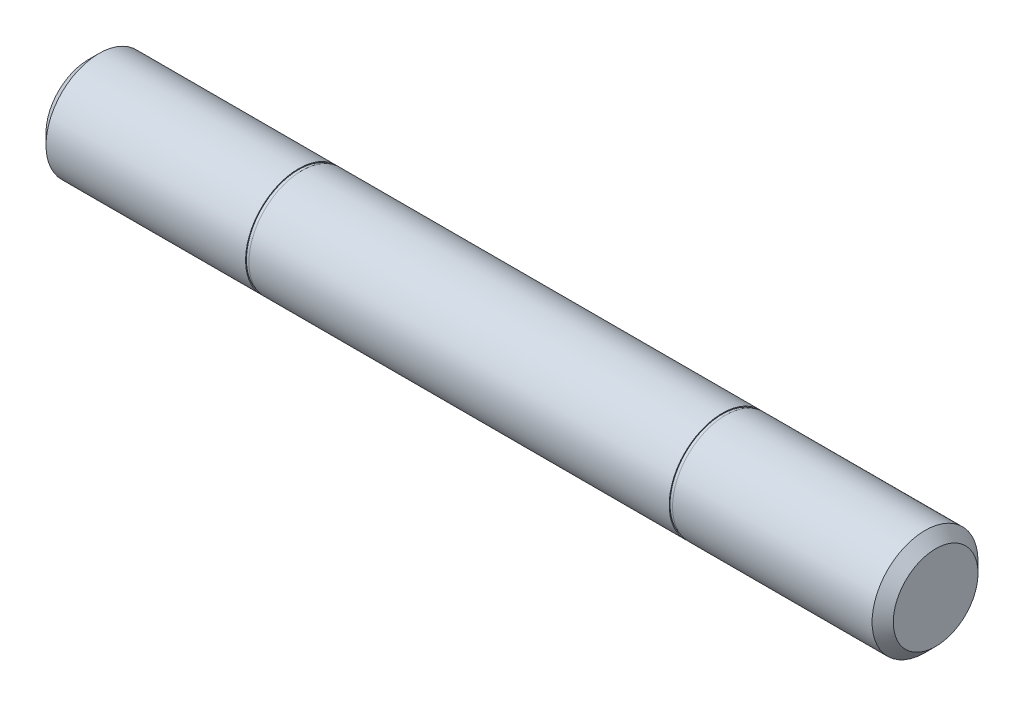
ISO-10303-21;
HEADER;
FILE_DESCRIPTION(('STEP AP214'),'2;1');
FILE_NAME('part.step','',(''),(''),'','','');
FILE_SCHEMA(('AUTOMOTIVE_DESIGN { 1 0 10303 214 1 1 1 1 }'));
ENDSEC;
DATA;
#1=APPLICATION_CONTEXT('core data for automotive mechanical design processes');
#2=APPLICATION_PROTOCOL_DEFINITION('international standard','automotive_design',2000,#1);
#3=PRODUCT_CONTEXT('',#1,'mechanical');
#4=PRODUCT('Part','Part','',(#3));
#5=PRODUCT_RELATED_PRODUCT_CATEGORY('part','',(#4));
#6=PRODUCT_DEFINITION_FORMATION('','',#4);
#7=PRODUCT_DEFINITION_CONTEXT('part definition',#1,'design');
#8=PRODUCT_DEFINITION('design','',#6,#7);
#9=PRODUCT_DEFINITION_SHAPE('','',#8);
#10=(LENGTH_UNIT() NAMED_UNIT(*) SI_UNIT(.MILLI.,.METRE.));
#11=(NAMED_UNIT(*) PLANE_ANGLE_UNIT() SI_UNIT($,.RADIAN.));
#12=(NAMED_UNIT(*) SI_UNIT($,.STERADIAN.) SOLID_ANGLE_UNIT());
#13=UNCERTAINTY_MEASURE_WITH_UNIT(LENGTH_MEASURE(1.E-05),#10,'distance_accuracy_value','');
#14=(GEOMETRIC_REPRESENTATION_CONTEXT(3) GLOBAL_UNCERTAINTY_ASSIGNED_CONTEXT((#13)) GLOBAL_UNIT_ASSIGNED_CONTEXT((#10,
#11,#12)) REPRESENTATION_CONTEXT('',''));
#15=CARTESIAN_POINT('',(0.,0.,0.));
#16=DIRECTION('',(0.,0.,1.));
#17=DIRECTION('',(1.,0.,0.));
#18=AXIS2_PLACEMENT_3D('',#15,#16,#17);
#19=CARTESIAN_POINT('',(-12.7,0.,0.));
#20=DIRECTION('',(1.,0.,0.));
#21=DIRECTION('',(0.,0.,-1.));
#22=AXIS2_PLACEMENT_3D('',#19,#20,#21);
#23=CYLINDRICAL_SURFACE('',#22,1.5875);
#24=CARTESIAN_POINT('',(-6.3,0.,0.));
#25=DIRECTION('',(-1.,0.,0.));
#26=DIRECTION('',(0.,0.,1.));
#27=AXIS2_PLACEMENT_3D('',#24,#25,#26);
#28=CIRCLE('',#27,1.5875);
#29=CARTESIAN_POINT('',(-6.3,0.,1.5875));
#30=VERTEX_POINT('',#29);
#31=EDGE_CURVE('E50',#30,#30,#28,.T.);
#32=ORIENTED_EDGE('',*,*,#31,.F.);
#33=EDGE_LOOP('',(#32));
#34=FACE_BOUND('',#33,.T.);
#35=CARTESIAN_POINT('',(6.3,0.,0.));
#36=DIRECTION('',(1.,0.,0.));
#37=DIRECTION('',(0.,0.,-1.));
#38=AXIS2_PLACEMENT_3D('',#35,#36,#37);
#39=CIRCLE('',#38,1.5875);
#40=CARTESIAN_POINT('',(6.3,0.,-1.5875));
#41=VERTEX_POINT('',#40);
#42=EDGE_CURVE('E60',#41,#41,#39,.T.);
#43=ORIENTED_EDGE('',*,*,#42,.F.);
#44=EDGE_LOOP('',(#43));
#45=FACE_BOUND('',#44,.T.);
#46=ADVANCED_FACE('F30',(#34,#45),#23,.T.);
#47=CARTESIAN_POINT('',(-6.3,0.,0.));
#48=DIRECTION('',(-1.,0.,0.));
#49=DIRECTION('',(0.,0.,1.));
#50=AXIS2_PLACEMENT_3D('',#47,#48,#49);
#51=PLANE('',#50);
#52=CARTESIAN_POINT('',(-6.3,0.,0.));
#53=DIRECTION('',(-1.,0.,0.));
#54=DIRECTION('',(0.,0.,1.));
#55=AXIS2_PLACEMENT_3D('',#52,#53,#54);
#56=CIRCLE('',#55,1.5621);
#57=CARTESIAN_POINT('',(-6.3,0.,1.5621));
#58=VERTEX_POINT('',#57);
#59=EDGE_CURVE('E54',#58,#58,#56,.T.);
#60=ORIENTED_EDGE('',*,*,#59,.F.);
#61=EDGE_LOOP('',(#60));
#62=FACE_BOUND('',#61,.T.);
#63=ORIENTED_EDGE('',*,*,#31,.T.);
#64=EDGE_LOOP('',(#63));
#65=FACE_BOUND('',#64,.T.);
#66=ADVANCED_FACE('F87',(#62,#65),#51,.T.);
#67=CARTESIAN_POINT('',(-6.4,0.,0.));
#68=DIRECTION('',(-1.,0.,0.));
#69=DIRECTION('',(0.,0.,1.));
#70=AXIS2_PLACEMENT_3D('',#67,#68,#69);
#71=PLANE('',#70);
#72=CARTESIAN_POINT('',(-6.4,0.,0.));
#73=DIRECTION('',(-1.,0.,0.));
#74=DIRECTION('',(0.,0.,1.));
#75=AXIS2_PLACEMENT_3D('',#72,#73,#74);
#76=CIRCLE('',#75,1.5621);
#77=CARTESIAN_POINT('',(-6.4,0.,1.5621));
#78=VERTEX_POINT('',#77);
#79=EDGE_CURVE('E57',#78,#78,#76,.T.);
#80=ORIENTED_EDGE('',*,*,#79,.T.);
#81=EDGE_LOOP('',(#80));
#82=FACE_BOUND('',#81,.T.);
#83=CARTESIAN_POINT('',(-6.4,0.,0.));
#84=DIRECTION('',(-1.,0.,0.));
#85=DIRECTION('',(0.,0.,1.));
#86=AXIS2_PLACEMENT_3D('',#83,#84,#85);
#87=CIRCLE('',#86,1.5875);
#88=CARTESIAN_POINT('',(-6.4,0.,1.5875));
#89=VERTEX_POINT('',#88);
#90=EDGE_CURVE('E51',#89,#89,#87,.T.);
#91=ORIENTED_EDGE('',*,*,#90,.F.);
#92=EDGE_LOOP('',(#91));
#93=FACE_BOUND('',#92,.T.);
#94=ADVANCED_FACE('F94',(#82,#93),#71,.F.);
#95=CARTESIAN_POINT('',(-6.3,0.,0.));
#96=DIRECTION('',(-1.,0.,0.));
#97=DIRECTION('',(0.,0.,1.));
#98=AXIS2_PLACEMENT_3D('',#95,#96,#97);
#99=CYLINDRICAL_SURFACE('',#98,1.5621);
#100=ORIENTED_EDGE('',*,*,#59,.T.);
#101=EDGE_LOOP('',(#100));
#102=FACE_BOUND('',#101,.T.);
#103=ORIENTED_EDGE('',*,*,#79,.F.);
#104=EDGE_LOOP('',(#103));
#105=FACE_BOUND('',#104,.T.);
#106=ADVANCED_FACE('F115',(#102,#105),#99,.T.);
#107=CARTESIAN_POINT('',(-12.7,0.,0.));
#108=DIRECTION('',(1.,0.,0.));
#109=DIRECTION('',(0.,0.,-1.));
#110=AXIS2_PLACEMENT_3D('',#107,#108,#109);
#111=PLANE('',#110);
#112=CARTESIAN_POINT('',(-12.7,0.,0.));
#113=DIRECTION('',(1.,0.,0.));
#114=DIRECTION('',(0.,0.,-1.));
#115=AXIS2_PLACEMENT_3D('',#112,#113,#114);
#116=CIRCLE('',#115,1.27);
#117=CARTESIAN_POINT('',(-12.7,0.,-1.27));
#118=VERTEX_POINT('',#117);
#119=EDGE_CURVE('E10',#118,#118,#116,.F.);
#120=ORIENTED_EDGE('',*,*,#119,.T.);
#121=EDGE_LOOP('',(#120));
#122=FACE_BOUND('',#121,.T.);
#123=ADVANCED_FACE('F107',(#122),#111,.F.);
#124=CARTESIAN_POINT('',(-12.3825,0.,0.));
#125=DIRECTION('',(1.,0.,0.));
#126=DIRECTION('',(0.,0.,-1.));
#127=AXIS2_PLACEMENT_3D('',#124,#125,#126);
#128=CONICAL_SURFACE('',#127,1.5875,0.78539816339745);
#129=ORIENTED_EDGE('',*,*,#119,.F.);
#130=EDGE_LOOP('',(#129));
#131=FACE_BOUND('',#130,.T.);
#132=CARTESIAN_POINT('',(-12.3825,0.,0.));
#133=DIRECTION('',(1.,0.,0.));
#134=DIRECTION('',(0.,0.,-1.));
#135=AXIS2_PLACEMENT_3D('',#132,#133,#134);
#136=CIRCLE('',#135,1.5875);
#137=CARTESIAN_POINT('',(-12.3825,0.,-1.5875));
#138=VERTEX_POINT('',#137);
#139=EDGE_CURVE('E41',#138,#138,#136,.T.);
#140=ORIENTED_EDGE('',*,*,#139,.F.);
#141=EDGE_LOOP('',(#140));
#142=FACE_BOUND('',#141,.T.);
#143=ADVANCED_FACE('F32',(#131,#142),#128,.T.);
#144=ORIENTED_EDGE('',*,*,#90,.T.);
#145=EDGE_LOOP('',(#144));
#146=FACE_BOUND('',#145,.T.);
#147=ORIENTED_EDGE('',*,*,#139,.T.);
#148=EDGE_LOOP('',(#147));
#149=FACE_BOUND('',#148,.T.);
#150=ADVANCED_FACE('F82',(#146,#149),#23,.T.);
#151=CARTESIAN_POINT('',(6.3,0.,0.));
#152=DIRECTION('',(1.,0.,0.));
#153=DIRECTION('',(0.,0.,-1.));
#154=AXIS2_PLACEMENT_3D('',#151,#152,#153);
#155=PLANE('',#154);
#156=CARTESIAN_POINT('',(6.3,0.,0.));
#157=DIRECTION('',(1.,0.,0.));
#158=DIRECTION('',(0.,0.,-1.));
#159=AXIS2_PLACEMENT_3D('',#156,#157,#158);
#160=CIRCLE('',#159,1.5621);
#161=CARTESIAN_POINT('',(6.3,0.,-1.5621));
#162=VERTEX_POINT('',#161);
#163=EDGE_CURVE('E66',#162,#162,#160,.T.);
#164=ORIENTED_EDGE('',*,*,#163,.F.);
#165=EDGE_LOOP('',(#164));
#166=FACE_BOUND('',#165,.T.);
#167=ORIENTED_EDGE('',*,*,#42,.T.);
#168=EDGE_LOOP('',(#167));
#169=FACE_BOUND('',#168,.T.);
#170=ADVANCED_FACE('F78',(#166,#169),#155,.T.);
#171=CARTESIAN_POINT('',(6.4,0.,0.));
#172=DIRECTION('',(1.,0.,0.));
#173=DIRECTION('',(0.,0.,-1.));
#174=AXIS2_PLACEMENT_3D('',#171,#172,#173);
#175=PLANE('',#174);
#176=CARTESIAN_POINT('',(6.4,0.,0.));
#177=DIRECTION('',(1.,0.,0.));
#178=DIRECTION('',(0.,0.,-1.));
#179=AXIS2_PLACEMENT_3D('',#176,#177,#178);
#180=CIRCLE('',#179,1.5621);
#181=CARTESIAN_POINT('',(6.4,0.,-1.5621));
#182=VERTEX_POINT('',#181);
#183=EDGE_CURVE('E69',#182,#182,#180,.T.);
#184=ORIENTED_EDGE('',*,*,#183,.T.);
#185=EDGE_LOOP('',(#184));
#186=FACE_BOUND('',#185,.T.);
#187=CARTESIAN_POINT('',(6.4,0.,0.));
#188=DIRECTION('',(1.,0.,0.));
#189=DIRECTION('',(0.,0.,-1.));
#190=AXIS2_PLACEMENT_3D('',#187,#188,#189);
#191=CIRCLE('',#190,1.5875);
#192=CARTESIAN_POINT('',(6.4,0.,-1.5875));
#193=VERTEX_POINT('',#192);
#194=EDGE_CURVE('E63',#193,#193,#191,.T.);
#195=ORIENTED_EDGE('',*,*,#194,.F.);
#196=EDGE_LOOP('',(#195));
#197=FACE_BOUND('',#196,.T.);
#198=ADVANCED_FACE('F81',(#186,#197),#175,.F.);
#199=CARTESIAN_POINT('',(6.3,0.,0.));
#200=DIRECTION('',(1.,0.,0.));
#201=DIRECTION('',(0.,0.,-1.));
#202=AXIS2_PLACEMENT_3D('',#199,#200,#201);
#203=CYLINDRICAL_SURFACE('',#202,1.5621);
#204=ORIENTED_EDGE('',*,*,#163,.T.);
#205=EDGE_LOOP('',(#204));
#206=FACE_BOUND('',#205,.T.);
#207=ORIENTED_EDGE('',*,*,#183,.F.);
#208=EDGE_LOOP('',(#207));
#209=FACE_BOUND('',#208,.T.);
#210=ADVANCED_FACE('F75',(#206,#209),#203,.T.);
#211=CARTESIAN_POINT('',(12.7,0.,0.));
#212=DIRECTION('',(1.,0.,0.));
#213=DIRECTION('',(0.,0.,-1.));
#214=AXIS2_PLACEMENT_3D('',#211,#212,#213);
#215=PLANE('',#214);
#216=CARTESIAN_POINT('',(12.7,0.,0.));
#217=DIRECTION('',(1.,0.,0.));
#218=DIRECTION('',(0.,0.,-1.));
#219=AXIS2_PLACEMENT_3D('',#216,#217,#218);
#220=CIRCLE('',#219,1.26999999999999);
#221=CARTESIAN_POINT('',(12.7,0.,-1.26999999999999));
#222=VERTEX_POINT('',#221);
#223=EDGE_CURVE('E45',#222,#222,#220,.T.);
#224=ORIENTED_EDGE('',*,*,#223,.T.);
#225=EDGE_LOOP('',(#224));
#226=FACE_BOUND('',#225,.T.);
#227=ADVANCED_FACE('F124',(#226),#215,.T.);
#228=CARTESIAN_POINT('',(12.7,0.,0.));
#229=DIRECTION('',(-1.,0.,0.));
#230=DIRECTION('',(0.,0.,1.));
#231=AXIS2_PLACEMENT_3D('',#228,#229,#230);
#232=CONICAL_SURFACE('',#231,1.26999999999999,0.78539816339745);
#233=CARTESIAN_POINT('',(12.3825,0.,0.));
#234=DIRECTION('',(1.,0.,0.));
#235=DIRECTION('',(0.,0.,-1.));
#236=AXIS2_PLACEMENT_3D('',#233,#234,#235);
#237=CIRCLE('',#236,1.5875);
#238=CARTESIAN_POINT('',(12.3825,0.,-1.5875));
#239=VERTEX_POINT('',#238);
#240=EDGE_CURVE('E37',#239,#239,#237,.F.);
#241=ORIENTED_EDGE('',*,*,#240,.F.);
#242=EDGE_LOOP('',(#241));
#243=FACE_BOUND('',#242,.T.);
#244=ORIENTED_EDGE('',*,*,#223,.F.);
#245=EDGE_LOOP('',(#244));
#246=FACE_BOUND('',#245,.T.);
#247=ADVANCED_FACE('F100',(#243,#246),#232,.T.);
#248=ORIENTED_EDGE('',*,*,#194,.T.);
#249=EDGE_LOOP('',(#248));
#250=FACE_BOUND('',#249,.T.);
#251=ORIENTED_EDGE('',*,*,#240,.T.);
#252=EDGE_LOOP('',(#251));
#253=FACE_BOUND('',#252,.T.);
#254=ADVANCED_FACE('F90',(#250,#253),#23,.T.);
#255=CLOSED_SHELL('',(#46,#66,#94,#106,#123,#143,#150,#170,#198,#210,#227,#247,#254));
#256=MANIFOLD_SOLID_BREP('B2',#255);
#257=ADVANCED_BREP_SHAPE_REPRESENTATION('',(#18,#256),#14);
#258=SHAPE_DEFINITION_REPRESENTATION(#9,#257);
ENDSEC;
END-ISO-10303-21;
